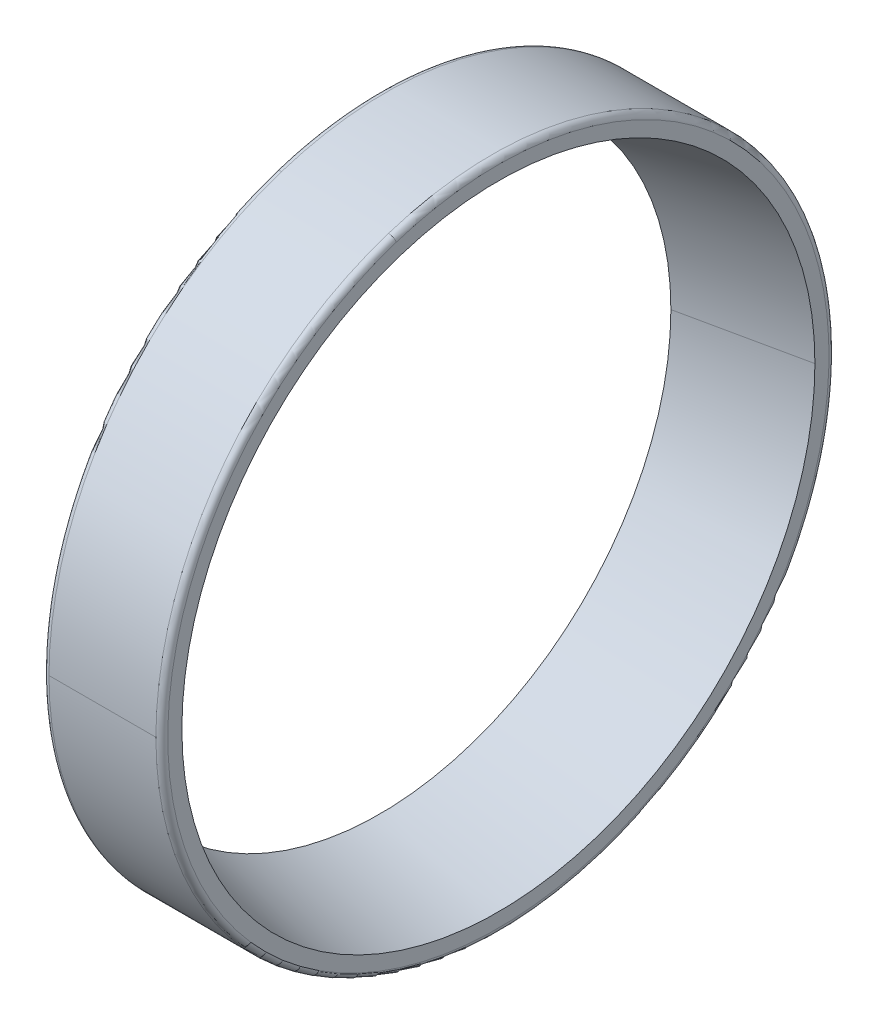
ISO-10303-21;
HEADER;
FILE_DESCRIPTION(('STEP AP214'),'2;1');
FILE_NAME('part.step','',(''),(''),'','','');
FILE_SCHEMA(('AUTOMOTIVE_DESIGN { 1 0 10303 214 1 1 1 1 }'));
ENDSEC;
DATA;
#1=APPLICATION_CONTEXT('core data for automotive mechanical design processes');
#2=APPLICATION_PROTOCOL_DEFINITION('international standard','automotive_design',2000,#1);
#3=PRODUCT_CONTEXT('',#1,'mechanical');
#4=PRODUCT('Part','Part','',(#3));
#5=PRODUCT_RELATED_PRODUCT_CATEGORY('part','',(#4));
#6=PRODUCT_DEFINITION_FORMATION('','',#4);
#7=PRODUCT_DEFINITION_CONTEXT('part definition',#1,'design');
#8=PRODUCT_DEFINITION('design','',#6,#7);
#9=PRODUCT_DEFINITION_SHAPE('','',#8);
#10=(LENGTH_UNIT() NAMED_UNIT(*) SI_UNIT(.MILLI.,.METRE.));
#11=(NAMED_UNIT(*) PLANE_ANGLE_UNIT() SI_UNIT($,.RADIAN.));
#12=(NAMED_UNIT(*) SI_UNIT($,.STERADIAN.) SOLID_ANGLE_UNIT());
#13=UNCERTAINTY_MEASURE_WITH_UNIT(LENGTH_MEASURE(1.E-05),#10,'distance_accuracy_value','');
#14=(GEOMETRIC_REPRESENTATION_CONTEXT(3) GLOBAL_UNCERTAINTY_ASSIGNED_CONTEXT((#13)) GLOBAL_UNIT_ASSIGNED_CONTEXT((#10,
#11,#12)) REPRESENTATION_CONTEXT('',''));
#15=CARTESIAN_POINT('',(0.,0.,0.));
#16=DIRECTION('',(0.,0.,1.));
#17=DIRECTION('',(1.,0.,0.));
#18=AXIS2_PLACEMENT_3D('',#15,#16,#17);
#19=CARTESIAN_POINT('',(-14.4000000000002,0.,0.));
#20=DIRECTION('',(1.,0.,0.));
#21=DIRECTION('',(0.,-0.309016994374947,0.951056516295154));
#22=AXIS2_PLACEMENT_3D('',#19,#20,#21);
#23=TOROIDAL_SURFACE('',#22,33.4,0.599999999999747);
#24=CARTESIAN_POINT('',(-14.4000000000002,-31.7652876442581,-10.3211676121232));
#25=DIRECTION('',(0.,0.309016994374946,-0.951056516295154));
#26=DIRECTION('',(3.9671969413289E-13,-0.951056516295154,-0.309016994374946));
#27=AXIS2_PLACEMENT_3D('',#24,#25,#26);
#28=CIRCLE('',#27,0.599999999999747);
#29=CARTESIAN_POINT('',(-14.4,-32.335921554035,-10.5065778087481));
#30=VERTEX_POINT('',#29);
#31=CARTESIAN_POINT('',(-15.,-31.7652876442581,-10.3211676121232));
#32=VERTEX_POINT('',#31);
#33=EDGE_CURVE('E11',#30,#32,#28,.T.);
#34=ORIENTED_EDGE('',*,*,#33,.T.);
#35=CARTESIAN_POINT('',(-15.,-31.7652876442581,-10.3211676121233));
#36=CARTESIAN_POINT('',(-15.,-31.5964187889525,-10.8409300230148));
#37=CARTESIAN_POINT('',(-15.,-31.4147717921887,-11.3565395268707));
#38=CARTESIAN_POINT('',(-15.,-31.0264067539412,-12.3782286786612));
#39=CARTESIAN_POINT('',(-15.,-30.8196887124575,-12.8843083265959));
#40=CARTESIAN_POINT('',(-15.,-30.3816668229671,-13.8857137246941));
#41=CARTESIAN_POINT('',(-15.,-30.1503629749603,-14.3810394748576));
#42=CARTESIAN_POINT('',(-15.,-29.6637301236686,-15.3597450942918));
#43=CARTESIAN_POINT('',(-15.,-29.4084011203838,-15.8431249635625));
#44=CARTESIAN_POINT('',(-15.,-28.8743321520789,-16.7967739684342));
#45=CARTESIAN_POINT('',(-15.,-28.5955921870589,-17.2670431040351));
#46=CARTESIAN_POINT('',(-15.,-28.0153730498199,-18.1933378153643));
#47=CARTESIAN_POINT('',(-15.,-27.7138938776011,-18.6493633910925));
#48=CARTESIAN_POINT('',(-15.,-27.0889225499031,-19.5460723521121));
#49=CARTESIAN_POINT('',(-15.,-26.765430394424,-19.9867557374035));
#50=CARTESIAN_POINT('',(-15.,-26.097212438772,-20.851718679376));
#51=CARTESIAN_POINT('',(-15.,-25.7524866385991,-21.2759982360572));
#52=CARTESIAN_POINT('',(-15.,-25.0426318634829,-22.1071313923992));
#53=CARTESIAN_POINT('',(-15.,-24.6775028885395,-22.5139849920601));
#54=CARTESIAN_POINT('',(-15.,-23.9277213928301,-23.3092860888849));
#55=CARTESIAN_POINT('',(-15.,-23.543068872064,-23.6977335860488));
#56=CARTESIAN_POINT('',(-15.,-22.7551669459844,-24.4552866737062));
#57=CARTESIAN_POINT('',(-15.,-22.3519175406707,-24.8243922641997));
#58=CARTESIAN_POINT('',(-15.,-21.5277933087244,-25.5423723308533));
#59=CARTESIAN_POINT('',(-15.,-21.1069184820918,-25.8912468070134));
#60=CARTESIAN_POINT('',(-15.,-20.248557331805,-26.5679241758204));
#61=CARTESIAN_POINT('',(-15.,-19.8110710081508,-26.8957270684671));
#62=CARTESIAN_POINT('',(-15.,-18.9205408067002,-27.5294715643692));
#63=CARTESIAN_POINT('',(-15.,-18.4674969289039,-27.8354131676245));
#64=CARTESIAN_POINT('',(-15.,-17.5469430415509,-28.4246980446235));
#65=CARTESIAN_POINT('',(-15.,-17.0794330319942,-28.7080413183671));
#66=CARTESIAN_POINT('',(-15.,-16.1310731536831,-29.2514469375785));
#67=CARTESIAN_POINT('',(-15.,-15.6502232849286,-29.5115092830462));
#68=CARTESIAN_POINT('',(-15.,-14.6763420976731,-30.0077265327368));
#69=CARTESIAN_POINT('',(-15.,-14.183310779172,-30.2438814369596));
#70=CARTESIAN_POINT('',(-15.,-13.186254448054,-30.6917148863113));
#71=CARTESIAN_POINT('',(-15.,-12.6822294354371,-30.9033934314402));
#72=CARTESIAN_POINT('',(-15.,-11.6643999564901,-31.3017642104479));
#73=CARTESIAN_POINT('',(-15.,-11.15059549016,-31.4884564443268));
#74=CARTESIAN_POINT('',(-15.,-10.1144449037502,-31.8364048428909));
#75=CARTESIAN_POINT('',(-15.,-9.59209878367043,-31.9976610075761));
#76=CARTESIAN_POINT('',(-15.,-8.54012326731648,-32.2943487875276));
#77=CARTESIAN_POINT('',(-15.,-8.01049387104232,-32.429780402794));
#78=CARTESIAN_POINT('',(-15.,-6.94522772590533,-32.6744928172843));
#79=CARTESIAN_POINT('',(-15.,-6.40959097704248,-32.7837736165082));
#80=CARTESIAN_POINT('',(-15.,-5.33360052257236,-32.9759211318965));
#81=CARTESIAN_POINT('',(-15.,-4.79324681696508,-33.0587878480609));
#82=CARTESIAN_POINT('',(-15.,-3.70912420841229,-33.1979075641525));
#83=CARTESIAN_POINT('',(-15.,-3.16535530546678,-33.2541605640798));
#84=CARTESIAN_POINT('',(-15.,-2.07571228915324,-33.3399173292932));
#85=CARTESIAN_POINT('',(-15.,-1.52983817578521,-33.3694210945793));
#86=CARTESIAN_POINT('',(-15.,-0.437299797178685,-33.4016083133557));
#87=CARTESIAN_POINT('',(-15.,0.109364468059809,-33.4042917668459));
#88=CARTESIAN_POINT('',(-15.,1.20216618831019,-33.382831897356));
#89=CARTESIAN_POINT('',(-15.,1.74830364332207,-33.3586885743758));
#90=CARTESIAN_POINT('',(-15.,2.8387360501541,-33.2836333153248));
#91=CARTESIAN_POINT('',(-15.,3.38303100197426,-33.232721379254));
#92=CARTESIAN_POINT('',(-15.,4.46846714820929,-33.1042515453351));
#93=CARTESIAN_POINT('',(-15.,5.00960834262417,-33.026693647487));
#94=CARTESIAN_POINT('',(-15.,6.08743331751295,-32.8451187337826));
#95=CARTESIAN_POINT('',(-15.,6.62411709798685,-32.7411017179264));
#96=CARTESIAN_POINT('',(-15.,7.69173432675854,-32.5068591543079));
#97=CARTESIAN_POINT('',(-15.,8.22266777505634,-32.3766336065456));
#98=CARTESIAN_POINT('',(-15.,9.2775052742946,-32.0902877038658));
#99=CARTESIAN_POINT('',(-15.,9.80140932523507,-31.9341673489484));
#100=CARTESIAN_POINT('',(-15.,10.8409258990114,-31.5964079395679));
#101=CARTESIAN_POINT('',(-15.,11.3565384218473,-31.4147688851049));
#102=CARTESIAN_POINT('',(-15.,12.3782297836845,-31.0264096610251));
#103=CARTESIAN_POINT('',(-15.,12.8843086226859,-30.8196894914083));
#104=CARTESIAN_POINT('',(-15.,13.8857134286039,-30.3816660440163));
#105=CARTESIAN_POINT('',(-15.,14.3810393955204,-30.1503627662411));
#106=CARTESIAN_POINT('',(-15.,15.3597451736289,-29.6637303323879));
#107=CARTESIAN_POINT('',(-15.,15.8431249848208,-29.40840117631));
#108=CARTESIAN_POINT('',(-15.,16.7967739471758,-28.8743320961528));
#109=CARTESIAN_POINT('',(-15.,17.2670430983389,-28.5955921720735));
#110=CARTESIAN_POINT('',(-15.,18.1933378210603,-28.0153730648054));
#111=CARTESIAN_POINT('',(-15.,18.6493633926187,-27.7138938816165));
#112=CARTESIAN_POINT('',(-15.,19.5460723505857,-27.0889225458879));
#113=CARTESIAN_POINT('',(-15.,19.9867557369944,-26.7654303933482));
#114=CARTESIAN_POINT('',(-15.,20.8517186797849,-26.097212439848));
#115=CARTESIAN_POINT('',(-15.,21.2759982361667,-25.7524866388875));
#116=CARTESIAN_POINT('',(-15.,22.1071313922896,-25.0426318631946));
#117=CARTESIAN_POINT('',(-15.,22.5139849920306,-24.6775028884623));
#118=CARTESIAN_POINT('',(-15.,23.3092860889142,-23.9277213929074));
#119=CARTESIAN_POINT('',(-15.,23.6977335860566,-23.5430688720848));
#120=CARTESIAN_POINT('',(-15.,24.4552866736983,-22.7551669459637));
#121=CARTESIAN_POINT('',(-15.,24.8243922641975,-22.3519175406652));
#122=CARTESIAN_POINT('',(-15.,25.5423723308553,-21.52779330873));
#123=CARTESIAN_POINT('',(-15.,25.891246807014,-21.1069184820934));
#124=CARTESIAN_POINT('',(-15.,26.5679241758198,-20.2485573318036));
#125=CARTESIAN_POINT('',(-15.,26.8957270684669,-19.8110710081505));
#126=CARTESIAN_POINT('',(-15.,27.5294715643693,-18.9205408067007));
#127=CARTESIAN_POINT('',(-15.,27.8354131676245,-18.4674969289041));
#128=CARTESIAN_POINT('',(-15.,28.4246980446234,-17.5469430415508));
#129=CARTESIAN_POINT('',(-15.,28.708041318367,-17.0794330319942));
#130=CARTESIAN_POINT('',(-15.,29.2514469375784,-16.1310731536832));
#131=CARTESIAN_POINT('',(-15.,29.5115092830462,-15.6502232849287));
#132=CARTESIAN_POINT('',(-15.,30.0077265327367,-14.6763420976731));
#133=CARTESIAN_POINT('',(-15.,30.2438814369595,-14.1833107791721));
#134=CARTESIAN_POINT('',(-15.,30.6917148863113,-13.1862544480541));
#135=CARTESIAN_POINT('',(-15.,30.9033934314402,-12.6822294354371));
#136=CARTESIAN_POINT('',(-15.,31.3017642104478,-11.6643999564902));
#137=CARTESIAN_POINT('',(-15.,31.4884564443264,-11.1505954901602));
#138=CARTESIAN_POINT('',(-15.,31.8364048428913,-10.1144449037502));
#139=CARTESIAN_POINT('',(-15.,31.9976610075776,-9.5920987836701));
#140=CARTESIAN_POINT('',(-15.,32.294348787526,-8.54012326731698));
#141=CARTESIAN_POINT('',(-15.,32.4297804027882,-8.01049387104396));
#142=CARTESIAN_POINT('',(-15.,32.67449281729,-6.94522772590386));
#143=CARTESIAN_POINT('',(-15.,32.7837736165296,-6.40959097703677));
#144=CARTESIAN_POINT('',(-15.,32.9759211318752,-5.33360052257826));
#145=CARTESIAN_POINT('',(-15.,33.0587878479811,-4.79324681698682));
#146=CARTESIAN_POINT('',(-15.,33.1979075642323,-3.70912420839073));
#147=CARTESIAN_POINT('',(-15.,33.2541605643774,-3.16535530538608));
#148=CARTESIAN_POINT('',(-15.,33.3399173289955,-2.07571228923414));
#149=CARTESIAN_POINT('',(-15.,33.3694210934685,-1.52983817608686));
#150=CARTESIAN_POINT('',(-15.,33.4016083144665,-0.437299796877262));
#151=CARTESIAN_POINT('',(-15.,33.4042917709915,0.109364469185056));
#152=CARTESIAN_POINT('',(-15.,33.3828318932104,1.20216618718472));
#153=CARTESIAN_POINT('',(-15.,33.3586885589043,1.74830363912207));
#154=CARTESIAN_POINT('',(-15.,33.2836333307964,2.83873605435391));
#155=CARTESIAN_POINT('',(-15.,33.2327214369945,3.3830310176484));
#156=CARTESIAN_POINT('',(-15.,33.1042514875946,4.46846713253499));
#157=CARTESIAN_POINT('',(-15.,33.0266934319964,5.00960828412708));
#158=CARTESIAN_POINT('',(-15.,32.8451189492732,6.08743337600989));
#159=CARTESIAN_POINT('',(-15.,32.7411025221482,6.6241173163006));
#160=CARTESIAN_POINT('',(-15.,32.5068583500861,7.69173410844461));
#161=CARTESIAN_POINT('',(-15.,32.3766306051489,8.22266696029791));
#162=CARTESIAN_POINT('',(-15.,32.0902907052625,9.27750608905285));
#163=CARTESIAN_POINT('',(-15.,31.9341785503133,9.80141236595448));
#164=CARTESIAN_POINT('',(-15.,31.7652876442582,10.3211676121231));
#165=B_SPLINE_CURVE_WITH_KNOTS('',3,(#35,#36,#37,#38,#39,#40,#41,#42,#43,#44,#45,#46,#47,#48,
#49,#50,#51,#52,#53,#54,#55,#56,#57,#58,#59,#60,#61,#62,#63,#64,#65,#66,#67,#68,#69,#70,#71,#72,
#73,#74,#75,#76,#77,#78,#79,#80,#81,#82,#83,#84,#85,#86,#87,#88,#89,#90,#91,#92,#93,#94,#95,#96,
#97,#98,#99,#100,#101,#102,#103,#104,#105,#106,#107,#108,#109,#110,#111,#112,#113,#114,#115,
#116,#117,#118,#119,#120,#121,#122,#123,#124,#125,#126,#127,#128,#129,#130,#131,#132,#133,#134,
#135,#136,#137,#138,#139,#140,#141,#142,#143,#144,#145,#146,#147,#148,#149,#150,#151,#152,#153,
#154,#155,#156,#157,#158,#159,#160,#161,#162,#163,#164),.UNSPECIFIED.,.F.,.F.,(4,2,2,2,2,2,2,2,
2,2,2,2,2,2,2,2,2,2,2,2,2,2,2,2,2,2,2,2,2,2,2,2,2,2,2,2,2,2,2,2,2,2,2,2,2,2,2,2,2,2,2,2,2,2,2,2,
2,2,2,2,2,2,2,2,4),(0.,1.63935406533053,3.27870813066108,4.91806219599161,6.55741626132216,
8.19677032665269,9.83612439198323,11.4754784573138,13.1148325226443,14.7541865879748,
16.3935406533054,18.0328947186359,19.6722487839664,21.311602849297,22.9509569146275,
24.5903109799581,26.2296650452886,27.8690191106191,29.5083731759497,31.1477272412802,
32.7870813066108,34.4264353719413,36.0657894372718,37.7051435026024,39.3444975679329,
40.9838516332635,42.623205698594,44.2625597639245,45.9019138292551,47.5412678945856,
49.1806219599161,50.8199760252467,52.4593300905772,54.0986841559077,55.7380382212383,
57.3773922865688,59.0167463518994,60.6561004172299,62.2954544825604,63.934808547891,
65.5741626132215,67.2135166785521,68.8528707438826,70.4922248092131,72.1315788745437,
73.7709329398742,75.4102870052047,77.0496410705353,78.6889951358658,80.3283492011964,
81.9677032665269,83.6070573318574,85.246411397188,86.8857654625185,88.525119527849,
90.1644735931796,91.8038276585101,93.4431817238407,95.0825357891712,96.7218898545017,
98.3612439198323,100.000597985163,101.639952050493,103.279306115824,104.918660181154),.UNSPECIFIED.);
#166=CARTESIAN_POINT('',(-15.,31.7652876442581,10.3211676121232));
#167=VERTEX_POINT('',#166);
#168=EDGE_CURVE('E26',#32,#167,#165,.T.);
#169=ORIENTED_EDGE('',*,*,#168,.T.);
#170=CARTESIAN_POINT('',(-14.4000000000002,31.7652876442581,10.3211676121232));
#171=DIRECTION('',(0.,-0.309016994374946,0.951056516295154));
#172=DIRECTION('',(3.99680288865225E-13,0.951056516295154,0.309016994374946));
#173=AXIS2_PLACEMENT_3D('',#170,#171,#172);
#174=CIRCLE('',#173,0.599999999999747);
#175=CARTESIAN_POINT('',(-14.4,32.335921554035,10.5065778087481));
#176=VERTEX_POINT('',#175);
#177=EDGE_CURVE('E221',#176,#167,#174,.T.);
#178=ORIENTED_EDGE('',*,*,#177,.F.);
#179=CARTESIAN_POINT('',(-14.4,0.,0.));
#180=DIRECTION('',(1.,0.,0.));
#181=DIRECTION('',(0.,0.,-1.));
#182=AXIS2_PLACEMENT_3D('',#179,#180,#181);
#183=CIRCLE('',#182,34.);
#184=CARTESIAN_POINT('',(-14.4,0.,-34.));
#185=VERTEX_POINT('',#184);
#186=EDGE_CURVE('E216',#185,#176,#183,.T.);
#187=ORIENTED_EDGE('',*,*,#186,.F.);
#188=CARTESIAN_POINT('',(-14.4,0.,0.));
#189=DIRECTION('',(1.,0.,0.));
#190=DIRECTION('',(0.,0.,-1.));
#191=AXIS2_PLACEMENT_3D('',#188,#189,#190);
#192=CIRCLE('',#191,34.);
#193=EDGE_CURVE('E211',#30,#185,#192,.T.);
#194=ORIENTED_EDGE('',*,*,#193,.F.);
#195=EDGE_LOOP('',(#34,#169,#178,#187,#194));
#196=FACE_BOUND('',#195,.T.);
#197=ADVANCED_FACE('F17',(#196),#23,.T.);
#198=CARTESIAN_POINT('',(-3.,0.,0.));
#199=DIRECTION('',(1.,0.,0.));
#200=DIRECTION('',(0.,1.,0.));
#201=AXIS2_PLACEMENT_3D('',#198,#199,#200);
#202=CYLINDRICAL_SURFACE('',#201,34.);
#203=DIRECTION('',(1.,0.,0.));
#204=VECTOR('',#203,1.);
#205=CARTESIAN_POINT('',(-14.4,0.,34.));
#206=LINE('',#205,#204);
#207=CARTESIAN_POINT('',(-14.4,0.,34.));
#208=VERTEX_POINT('',#207);
#209=CARTESIAN_POINT('',(-3.6,0.,34.));
#210=VERTEX_POINT('',#209);
#211=EDGE_CURVE('E206',#208,#210,#206,.T.);
#212=ORIENTED_EDGE('',*,*,#211,.F.);
#213=CARTESIAN_POINT('',(-14.4,0.,0.));
#214=DIRECTION('',(1.,0.,0.));
#215=DIRECTION('',(0.,0.,-1.));
#216=AXIS2_PLACEMENT_3D('',#213,#214,#215);
#217=CIRCLE('',#216,34.);
#218=EDGE_CURVE('E201',#208,#30,#217,.T.);
#219=ORIENTED_EDGE('',*,*,#218,.T.);
#220=ORIENTED_EDGE('',*,*,#193,.T.);
#221=DIRECTION('',(1.,0.,0.));
#222=VECTOR('',#221,1.);
#223=CARTESIAN_POINT('',(-14.4,0.,-34.));
#224=LINE('',#223,#222);
#225=CARTESIAN_POINT('',(-3.6,0.,-34.));
#226=VERTEX_POINT('',#225);
#227=EDGE_CURVE('E197',#185,#226,#224,.T.);
#228=ORIENTED_EDGE('',*,*,#227,.T.);
#229=CARTESIAN_POINT('',(-3.6,0.,0.));
#230=DIRECTION('',(1.,0.,0.));
#231=DIRECTION('',(0.,0.,-1.));
#232=AXIS2_PLACEMENT_3D('',#229,#230,#231);
#233=CIRCLE('',#232,34.);
#234=CARTESIAN_POINT('',(-3.6,-32.3359215540352,-10.5065778087482));
#235=VERTEX_POINT('',#234);
#236=EDGE_CURVE('E192',#235,#226,#233,.T.);
#237=ORIENTED_EDGE('',*,*,#236,.F.);
#238=CARTESIAN_POINT('',(-3.6,0.,0.));
#239=DIRECTION('',(1.,0.,0.));
#240=DIRECTION('',(0.,0.,-1.));
#241=AXIS2_PLACEMENT_3D('',#238,#239,#240);
#242=CIRCLE('',#241,34.);
#243=EDGE_CURVE('E187',#210,#235,#242,.T.);
#244=ORIENTED_EDGE('',*,*,#243,.F.);
#245=EDGE_LOOP('',(#212,#219,#220,#228,#237,#244));
#246=FACE_BOUND('',#245,.T.);
#247=ADVANCED_FACE('F242',(#246),#202,.T.);
#248=CARTESIAN_POINT('',(-3.59999999999993,0.,0.));
#249=DIRECTION('',(1.,0.,0.));
#250=DIRECTION('',(0.,0.309016994374947,-0.951056516295154));
#251=AXIS2_PLACEMENT_3D('',#248,#249,#250);
#252=TOROIDAL_SURFACE('',#251,33.4,0.59999999999993);
#253=CARTESIAN_POINT('',(-3.59999999999993,-31.7652876442581,-10.3211676121232));
#254=DIRECTION('',(0.,0.309016994374947,-0.951056516295154));
#255=DIRECTION('',(1.,0.,0.));
#256=AXIS2_PLACEMENT_3D('',#253,#254,#255);
#257=CIRCLE('',#256,0.59999999999993);
#258=CARTESIAN_POINT('',(-3.,-31.7652876442581,-10.3211676121232));
#259=VERTEX_POINT('',#258);
#260=EDGE_CURVE('E182',#259,#235,#257,.T.);
#261=ORIENTED_EDGE('',*,*,#260,.F.);
#262=CARTESIAN_POINT('',(-3.,0.,0.));
#263=DIRECTION('',(1.,0.,0.));
#264=DIRECTION('',(0.,0.,-1.));
#265=AXIS2_PLACEMENT_3D('',#262,#263,#264);
#266=CIRCLE('',#265,33.4);
#267=CARTESIAN_POINT('',(-3.,31.7652876442581,10.3211676121232));
#268=VERTEX_POINT('',#267);
#269=EDGE_CURVE('E177',#268,#259,#266,.T.);
#270=ORIENTED_EDGE('',*,*,#269,.F.);
#271=CARTESIAN_POINT('',(-3.59999999999993,31.7652876442581,10.3211676121232));
#272=DIRECTION('',(0.,-0.309016994374947,0.951056516295154));
#273=DIRECTION('',(1.,0.,0.));
#274=AXIS2_PLACEMENT_3D('',#271,#272,#273);
#275=CIRCLE('',#274,0.59999999999993);
#276=CARTESIAN_POINT('',(-3.6,32.3359215540352,10.5065778087482));
#277=VERTEX_POINT('',#276);
#278=EDGE_CURVE('E173',#268,#277,#275,.T.);
#279=ORIENTED_EDGE('',*,*,#278,.T.);
#280=CARTESIAN_POINT('',(-3.6,0.,0.));
#281=DIRECTION('',(1.,0.,0.));
#282=DIRECTION('',(0.,0.,-1.));
#283=AXIS2_PLACEMENT_3D('',#280,#281,#282);
#284=CIRCLE('',#283,34.);
#285=EDGE_CURVE('E168',#277,#210,#284,.T.);
#286=ORIENTED_EDGE('',*,*,#285,.T.);
#287=ORIENTED_EDGE('',*,*,#243,.T.);
#288=EDGE_LOOP('',(#261,#270,#279,#286,#287));
#289=FACE_BOUND('',#288,.T.);
#290=ADVANCED_FACE('F244',(#289),#252,.T.);
#291=CARTESIAN_POINT('',(-3.,0.,0.));
#292=DIRECTION('',(1.,0.,0.));
#293=DIRECTION('',(0.,-1.,0.));
#294=AXIS2_PLACEMENT_3D('',#291,#292,#293);
#295=CYLINDRICAL_SURFACE('',#294,34.);
#296=ORIENTED_EDGE('',*,*,#211,.T.);
#297=ORIENTED_EDGE('',*,*,#285,.F.);
#298=CARTESIAN_POINT('',(-3.6,0.,0.));
#299=DIRECTION('',(1.,0.,0.));
#300=DIRECTION('',(0.,0.,-1.));
#301=AXIS2_PLACEMENT_3D('',#298,#299,#300);
#302=CIRCLE('',#301,34.);
#303=EDGE_CURVE('E163',#226,#277,#302,.T.);
#304=ORIENTED_EDGE('',*,*,#303,.F.);
#305=ORIENTED_EDGE('',*,*,#227,.F.);
#306=ORIENTED_EDGE('',*,*,#186,.T.);
#307=CARTESIAN_POINT('',(-14.4,0.,0.));
#308=DIRECTION('',(1.,0.,0.));
#309=DIRECTION('',(0.,0.,-1.));
#310=AXIS2_PLACEMENT_3D('',#307,#308,#309);
#311=CIRCLE('',#310,34.);
#312=EDGE_CURVE('E160',#176,#208,#311,.T.);
#313=ORIENTED_EDGE('',*,*,#312,.T.);
#314=EDGE_LOOP('',(#296,#297,#304,#305,#306,#313));
#315=FACE_BOUND('',#314,.T.);
#316=ADVANCED_FACE('F238',(#315),#295,.T.);
#317=CARTESIAN_POINT('',(-14.4000000000002,0.,0.));
#318=DIRECTION('',(1.,0.,0.));
#319=DIRECTION('',(0.,0.309016994374947,-0.951056516295154));
#320=AXIS2_PLACEMENT_3D('',#317,#318,#319);
#321=TOROIDAL_SURFACE('',#320,33.4,0.599999999999747);
#322=ORIENTED_EDGE('',*,*,#33,.F.);
#323=ORIENTED_EDGE('',*,*,#218,.F.);
#324=ORIENTED_EDGE('',*,*,#312,.F.);
#325=ORIENTED_EDGE('',*,*,#177,.T.);
#326=CARTESIAN_POINT('',(-15.,31.7652876442581,10.3211676121233));
#327=CARTESIAN_POINT('',(-15.,31.5964187889525,10.8409300230148));
#328=CARTESIAN_POINT('',(-15.,31.4147717921887,11.3565395268707));
#329=CARTESIAN_POINT('',(-15.,31.0264067539412,12.3782286786612));
#330=CARTESIAN_POINT('',(-15.,30.8196887124575,12.8843083265959));
#331=CARTESIAN_POINT('',(-15.,30.3816668229671,13.8857137246941));
#332=CARTESIAN_POINT('',(-15.,30.1503629749603,14.3810394748576));
#333=CARTESIAN_POINT('',(-15.,29.6637301236686,15.3597450942918));
#334=CARTESIAN_POINT('',(-15.,29.4084011203838,15.8431249635626));
#335=CARTESIAN_POINT('',(-15.,28.8743321520789,16.7967739684342));
#336=CARTESIAN_POINT('',(-15.,28.5955921870589,17.2670431040351));
#337=CARTESIAN_POINT('',(-15.,28.0153730498199,18.1933378153643));
#338=CARTESIAN_POINT('',(-15.,27.7138938776011,18.6493633910925));
#339=CARTESIAN_POINT('',(-15.,27.0889225499031,19.5460723521121));
#340=CARTESIAN_POINT('',(-15.,26.765430394424,19.9867557374035));
#341=CARTESIAN_POINT('',(-15.,26.097212438772,20.851718679376));
#342=CARTESIAN_POINT('',(-15.,25.7524866385991,21.2759982360572));
#343=CARTESIAN_POINT('',(-15.,25.0426318634828,22.1071313923992));
#344=CARTESIAN_POINT('',(-15.,24.6775028885395,22.5139849920601));
#345=CARTESIAN_POINT('',(-15.,23.92772139283,23.3092860888849));
#346=CARTESIAN_POINT('',(-15.,23.543068872064,23.6977335860488));
#347=CARTESIAN_POINT('',(-15.,22.7551669459843,24.4552866737062));
#348=CARTESIAN_POINT('',(-15.,22.3519175406707,24.8243922641997));
#349=CARTESIAN_POINT('',(-15.,21.5277933087244,25.5423723308533));
#350=CARTESIAN_POINT('',(-15.,21.1069184820918,25.8912468070135));
#351=CARTESIAN_POINT('',(-15.,20.248557331805,26.5679241758204));
#352=CARTESIAN_POINT('',(-15.,19.8110710081508,26.8957270684671));
#353=CARTESIAN_POINT('',(-15.,18.9205408067002,27.5294715643692));
#354=CARTESIAN_POINT('',(-15.,18.4674969289039,27.8354131676245));
#355=CARTESIAN_POINT('',(-15.,17.5469430415508,28.4246980446235));
#356=CARTESIAN_POINT('',(-15.,17.0794330319942,28.7080413183671));
#357=CARTESIAN_POINT('',(-15.,16.131073153683,29.2514469375785));
#358=CARTESIAN_POINT('',(-15.,15.6502232849286,29.5115092830462));
#359=CARTESIAN_POINT('',(-15.,14.676342097673,30.0077265327368));
#360=CARTESIAN_POINT('',(-15.,14.183310779172,30.2438814369596));
#361=CARTESIAN_POINT('',(-15.,13.186254448054,30.6917148863113));
#362=CARTESIAN_POINT('',(-15.,12.682229435437,30.9033934314402));
#363=CARTESIAN_POINT('',(-15.,11.66439995649,31.3017642104479));
#364=CARTESIAN_POINT('',(-15.,11.15059549016,31.4884564443268));
#365=CARTESIAN_POINT('',(-15.,10.1144449037502,31.8364048428909));
#366=CARTESIAN_POINT('',(-15.,9.59209878367039,31.9976610075761));
#367=CARTESIAN_POINT('',(-15.,8.54012326731645,32.2943487875276));
#368=CARTESIAN_POINT('',(-15.,8.01049387104229,32.429780402794));
#369=CARTESIAN_POINT('',(-15.,6.94522772590529,32.6744928172843));
#370=CARTESIAN_POINT('',(-15.,6.40959097704244,32.7837736165082));
#371=CARTESIAN_POINT('',(-15.,5.33360052257231,32.9759211318966));
#372=CARTESIAN_POINT('',(-15.,4.79324681696504,33.0587878480609));
#373=CARTESIAN_POINT('',(-15.,3.70912420841225,33.1979075641525));
#374=CARTESIAN_POINT('',(-15.,3.16535530546673,33.2541605640798));
#375=CARTESIAN_POINT('',(-15.,2.0757122891532,33.3399173292932));
#376=CARTESIAN_POINT('',(-15.,1.52983817578517,33.3694210945793));
#377=CARTESIAN_POINT('',(-15.,0.437299797178647,33.4016083133557));
#378=CARTESIAN_POINT('',(-15.,-0.109364468059853,33.4042917668459));
#379=CARTESIAN_POINT('',(-15.,-1.20216618831024,33.382831897356));
#380=CARTESIAN_POINT('',(-15.,-1.74830364332212,33.3586885743758));
#381=CARTESIAN_POINT('',(-15.,-2.83873605015416,33.2836333153248));
#382=CARTESIAN_POINT('',(-15.,-3.38303100197432,33.232721379254));
#383=CARTESIAN_POINT('',(-15.,-4.46846714820935,33.1042515453351));
#384=CARTESIAN_POINT('',(-15.,-5.00960834262423,33.026693647487));
#385=CARTESIAN_POINT('',(-15.,-6.08743331751301,32.8451187337826));
#386=CARTESIAN_POINT('',(-15.,-6.62411709798691,32.7411017179264));
#387=CARTESIAN_POINT('',(-15.,-7.6917343267586,32.5068591543079));
#388=CARTESIAN_POINT('',(-15.,-8.2226677750564,32.3766336065456));
#389=CARTESIAN_POINT('',(-15.,-9.27750527429466,32.0902877038658));
#390=CARTESIAN_POINT('',(-15.,-9.80140932523513,31.9341673489484));
#391=CARTESIAN_POINT('',(-15.,-10.8409258990115,31.5964079395679));
#392=CARTESIAN_POINT('',(-15.,-11.3565384218473,31.4147688851048));
#393=CARTESIAN_POINT('',(-15.,-12.3782297836846,31.0264096610251));
#394=CARTESIAN_POINT('',(-15.,-12.884308622686,30.8196894914083));
#395=CARTESIAN_POINT('',(-15.,-13.8857134286039,30.3816660440163));
#396=CARTESIAN_POINT('',(-15.,-14.3810393955205,30.150362766241));
#397=CARTESIAN_POINT('',(-15.,-15.3597451736289,29.6637303323879));
#398=CARTESIAN_POINT('',(-15.,-15.8431249848208,29.40840117631));
#399=CARTESIAN_POINT('',(-15.,-16.7967739471758,28.8743320961528));
#400=CARTESIAN_POINT('',(-15.,-17.2670430983389,28.5955921720735));
#401=CARTESIAN_POINT('',(-15.,-18.1933378210604,28.0153730648053));
#402=CARTESIAN_POINT('',(-15.,-18.6493633926188,27.7138938816164));
#403=CARTESIAN_POINT('',(-15.,-19.5460723505858,27.0889225458878));
#404=CARTESIAN_POINT('',(-15.,-19.9867557369945,26.7654303933481));
#405=CARTESIAN_POINT('',(-15.,-20.8517186797849,26.0972124398479));
#406=CARTESIAN_POINT('',(-15.,-21.2759982361667,25.7524866388874));
#407=CARTESIAN_POINT('',(-15.,-22.1071313922896,25.0426318631946));
#408=CARTESIAN_POINT('',(-15.,-22.5139849920307,24.6775028884622));
#409=CARTESIAN_POINT('',(-15.,-23.3092860889142,23.9277213929073));
#410=CARTESIAN_POINT('',(-15.,-23.6977335860567,23.5430688720848));
#411=CARTESIAN_POINT('',(-15.,-24.4552866736983,22.7551669459637));
#412=CARTESIAN_POINT('',(-15.,-24.8243922641976,22.3519175406651));
#413=CARTESIAN_POINT('',(-15.,-25.5423723308554,21.52779330873));
#414=CARTESIAN_POINT('',(-15.,-25.891246807014,21.1069184820933));
#415=CARTESIAN_POINT('',(-15.,-26.5679241758198,20.2485573318035));
#416=CARTESIAN_POINT('',(-15.,-26.895727068467,19.8110710081504));
#417=CARTESIAN_POINT('',(-15.,-27.5294715643694,18.9205408067006));
#418=CARTESIAN_POINT('',(-15.,-27.8354131676246,18.467496928904));
#419=CARTESIAN_POINT('',(-15.,-28.4246980446234,17.5469430415508));
#420=CARTESIAN_POINT('',(-15.,-28.7080413183671,17.0794330319942));
#421=CARTESIAN_POINT('',(-15.,-29.2514469375785,16.1310731536831));
#422=CARTESIAN_POINT('',(-15.,-29.5115092830462,15.6502232849286));
#423=CARTESIAN_POINT('',(-15.,-30.0077265327368,14.6763420976731));
#424=CARTESIAN_POINT('',(-15.,-30.2438814369596,14.183310779172));
#425=CARTESIAN_POINT('',(-15.,-30.6917148863113,13.186254448054));
#426=CARTESIAN_POINT('',(-15.,-30.9033934314403,12.682229435437));
#427=CARTESIAN_POINT('',(-15.,-31.3017642104478,11.6643999564901));
#428=CARTESIAN_POINT('',(-15.,-31.4884564443264,11.1505954901602));
#429=CARTESIAN_POINT('',(-15.,-31.8364048428913,10.1144449037501));
#430=CARTESIAN_POINT('',(-15.,-31.9976610075776,9.59209878367001));
#431=CARTESIAN_POINT('',(-15.,-32.2943487875261,8.5401232673169));
#432=CARTESIAN_POINT('',(-15.,-32.4297804027882,8.01049387104388));
#433=CARTESIAN_POINT('',(-15.,-32.67449281729,6.94522772590377));
#434=CARTESIAN_POINT('',(-15.,-32.7837736165296,6.40959097703668));
#435=CARTESIAN_POINT('',(-15.,-32.9759211318752,5.33360052257815));
#436=CARTESIAN_POINT('',(-15.,-33.0587878479812,4.79324681698671));
#437=CARTESIAN_POINT('',(-15.,-33.1979075642323,3.70912420839061));
#438=CARTESIAN_POINT('',(-15.,-33.2541605643774,3.16535530538595));
#439=CARTESIAN_POINT('',(-15.,-33.3399173289955,2.07571228923401));
#440=CARTESIAN_POINT('',(-15.,-33.3694210934685,1.52983817608674));
#441=CARTESIAN_POINT('',(-15.,-33.4016083144665,0.43729979687714));
#442=CARTESIAN_POINT('',(-15.,-33.4042917709915,-0.109364469185179));
#443=CARTESIAN_POINT('',(-15.,-33.3828318932104,-1.20216618718484));
#444=CARTESIAN_POINT('',(-15.,-33.3586885589043,-1.74830363912219));
#445=CARTESIAN_POINT('',(-15.,-33.2836333307964,-2.83873605435403));
#446=CARTESIAN_POINT('',(-15.,-33.2327214369945,-3.38303101764852));
#447=CARTESIAN_POINT('',(-15.,-33.1042514875945,-4.46846713253511));
#448=CARTESIAN_POINT('',(-15.,-33.0266934319964,-5.0096082841272));
#449=CARTESIAN_POINT('',(-15.,-32.8451189492732,-6.08743337601001));
#450=CARTESIAN_POINT('',(-15.,-32.7411025221482,-6.62411731630072));
#451=CARTESIAN_POINT('',(-15.,-32.506858350086,-7.69173410844473));
#452=CARTESIAN_POINT('',(-15.,-32.3766306051489,-8.22266696029803));
#453=CARTESIAN_POINT('',(-15.,-32.0902907052625,-9.27750608905296));
#454=CARTESIAN_POINT('',(-15.,-31.9341785503133,-9.8014123659546));
#455=CARTESIAN_POINT('',(-15.,-31.7652876442581,-10.3211676121233));
#456=B_SPLINE_CURVE_WITH_KNOTS('',3,(#326,#327,#328,#329,#330,#331,#332,#333,#334,#335,#336,
#337,#338,#339,#340,#341,#342,#343,#344,#345,#346,#347,#348,#349,#350,#351,#352,#353,#354,#355,
#356,#357,#358,#359,#360,#361,#362,#363,#364,#365,#366,#367,#368,#369,#370,#371,#372,#373,#374,
#375,#376,#377,#378,#379,#380,#381,#382,#383,#384,#385,#386,#387,#388,#389,#390,#391,#392,#393,
#394,#395,#396,#397,#398,#399,#400,#401,#402,#403,#404,#405,#406,#407,#408,#409,#410,#411,#412,
#413,#414,#415,#416,#417,#418,#419,#420,#421,#422,#423,#424,#425,#426,#427,#428,#429,#430,#431,
#432,#433,#434,#435,#436,#437,#438,#439,#440,#441,#442,#443,#444,#445,#446,#447,#448,#449,#450,
#451,#452,#453,#454,#455),.UNSPECIFIED.,.F.,.F.,(4,2,2,2,2,2,2,2,2,2,2,2,2,2,2,2,2,2,2,2,2,2,2,
2,2,2,2,2,2,2,2,2,2,2,2,2,2,2,2,2,2,2,2,2,2,2,2,2,2,2,2,2,2,2,2,2,2,2,2,2,2,2,2,2,4),(0.,
1.63935406533053,3.27870813066108,4.91806219599162,6.55741626132216,8.1967703266527,
9.83612439198324,11.4754784573138,13.1148325226443,14.7541865879749,16.3935406533054,
18.0328947186359,19.6722487839665,21.311602849297,22.9509569146276,24.5903109799581,
26.2296650452886,27.8690191106192,29.5083731759497,31.1477272412803,32.7870813066108,
34.4264353719413,36.0657894372719,37.7051435026024,39.3444975679329,40.9838516332635,
42.623205698594,44.2625597639246,45.9019138292551,47.5412678945857,49.1806219599162,
50.8199760252467,52.4593300905773,54.0986841559078,55.7380382212383,57.3773922865689,
59.0167463518994,60.65610041723,62.2954544825605,63.934808547891,65.5741626132216,
67.2135166785521,68.8528707438827,70.4922248092132,72.1315788745438,73.7709329398743,
75.4102870052048,77.0496410705354,78.6889951358659,80.3283492011965,81.967703266527,
83.6070573318576,85.2464113971881,86.8857654625186,88.5251195278492,90.1644735931797,
91.8038276585103,93.4431817238408,95.0825357891713,96.7218898545019,98.3612439198324,
100.000597985163,101.639952050494,103.279306115824,104.918660181155),.UNSPECIFIED.);
#457=EDGE_CURVE('E146',#167,#32,#456,.T.);
#458=ORIENTED_EDGE('',*,*,#457,.T.);
#459=EDGE_LOOP('',(#322,#323,#324,#325,#458));
#460=FACE_BOUND('',#459,.T.);
#461=ADVANCED_FACE('F126',(#460),#321,.T.);
#462=CARTESIAN_POINT('',(-15.,33.4,0.));
#463=DIRECTION('',(-1.,0.,0.));
#464=DIRECTION('',(0.,0.,1.));
#465=AXIS2_PLACEMENT_3D('',#462,#463,#464);
#466=PLANE('',#465);
#467=CARTESIAN_POINT('',(-15.,0.,0.));
#468=DIRECTION('',(1.,0.,0.));
#469=DIRECTION('',(0.,0.,-1.));
#470=AXIS2_PLACEMENT_3D('',#467,#468,#469);
#471=CIRCLE('',#470,29.426);
#472=CARTESIAN_POINT('',(-15.,0.,-29.426));
#473=VERTEX_POINT('',#472);
#474=CARTESIAN_POINT('',(-15.,0.,29.426));
#475=VERTEX_POINT('',#474);
#476=EDGE_CURVE('E98',#473,#475,#471,.T.);
#477=ORIENTED_EDGE('',*,*,#476,.T.);
#478=CARTESIAN_POINT('',(-15.,0.,0.));
#479=DIRECTION('',(1.,0.,0.));
#480=DIRECTION('',(0.,0.,-1.));
#481=AXIS2_PLACEMENT_3D('',#478,#479,#480);
#482=CIRCLE('',#481,29.426);
#483=EDGE_CURVE('E108',#475,#473,#482,.T.);
#484=ORIENTED_EDGE('',*,*,#483,.T.);
#485=EDGE_LOOP('',(#477,#484));
#486=FACE_BOUND('',#485,.T.);
#487=ORIENTED_EDGE('',*,*,#168,.F.);
#488=ORIENTED_EDGE('',*,*,#457,.F.);
#489=EDGE_LOOP('',(#487,#488));
#490=FACE_BOUND('',#489,.T.);
#491=ADVANCED_FACE('F116',(#486,#490),#466,.T.);
#492=CARTESIAN_POINT('',(-15.,0.,0.));
#493=DIRECTION('',(1.,0.,0.));
#494=DIRECTION('',(0.,1.,0.));
#495=AXIS2_PLACEMENT_3D('',#492,#493,#494);
#496=CONICAL_SURFACE('',#495,29.426,0.209425259063146);
#497=DIRECTION('',(0.978150563620611,0.,0.207897751042865));
#498=VECTOR('',#497,1.);
#499=CARTESIAN_POINT('',(-15.,0.,29.426));
#500=LINE('',#499,#498);
#501=CARTESIAN_POINT('',(-2.99999999999997,0.,31.9765));
#502=VERTEX_POINT('',#501);
#503=EDGE_CURVE('E88',#475,#502,#500,.T.);
#504=ORIENTED_EDGE('',*,*,#503,.T.);
#505=CARTESIAN_POINT('',(-3.,0.,0.));
#506=DIRECTION('',(1.,0.,0.));
#507=DIRECTION('',(0.,0.,-1.));
#508=AXIS2_PLACEMENT_3D('',#505,#506,#507);
#509=CIRCLE('',#508,31.9765);
#510=CARTESIAN_POINT('',(-3.,0.,-31.9765));
#511=VERTEX_POINT('',#510);
#512=EDGE_CURVE('E80',#502,#511,#509,.T.);
#513=ORIENTED_EDGE('',*,*,#512,.T.);
#514=DIRECTION('',(0.978150563620611,0.,-0.207897751042865));
#515=VECTOR('',#514,1.);
#516=CARTESIAN_POINT('',(-15.,0.,-29.426));
#517=LINE('',#516,#515);
#518=EDGE_CURVE('E85',#473,#511,#517,.T.);
#519=ORIENTED_EDGE('',*,*,#518,.F.);
#520=ORIENTED_EDGE('',*,*,#483,.F.);
#521=EDGE_LOOP('',(#504,#513,#519,#520));
#522=FACE_BOUND('',#521,.T.);
#523=ADVANCED_FACE('F82',(#522),#496,.F.);
#524=CARTESIAN_POINT('',(-15.,0.,0.));
#525=DIRECTION('',(1.,0.,0.));
#526=DIRECTION('',(0.,-1.,0.));
#527=AXIS2_PLACEMENT_3D('',#524,#525,#526);
#528=CONICAL_SURFACE('',#527,29.426,0.209425259063146);
#529=ORIENTED_EDGE('',*,*,#503,.F.);
#530=ORIENTED_EDGE('',*,*,#476,.F.);
#531=ORIENTED_EDGE('',*,*,#518,.T.);
#532=CARTESIAN_POINT('',(-3.,0.,0.));
#533=DIRECTION('',(1.,0.,0.));
#534=DIRECTION('',(0.,0.,-1.));
#535=AXIS2_PLACEMENT_3D('',#532,#533,#534);
#536=CIRCLE('',#535,31.9765);
#537=EDGE_CURVE('E92',#511,#502,#536,.T.);
#538=ORIENTED_EDGE('',*,*,#537,.T.);
#539=EDGE_LOOP('',(#529,#530,#531,#538));
#540=FACE_BOUND('',#539,.T.);
#541=ADVANCED_FACE('F97',(#540),#528,.F.);
#542=CARTESIAN_POINT('',(-3.,31.9765,0.));
#543=DIRECTION('',(1.,0.,0.));
#544=DIRECTION('',(0.,0.,-1.));
#545=AXIS2_PLACEMENT_3D('',#542,#543,#544);
#546=PLANE('',#545);
#547=ORIENTED_EDGE('',*,*,#269,.T.);
#548=CARTESIAN_POINT('',(-3.,-31.7652876442581,-10.3211676121232));
#549=CARTESIAN_POINT('',(-3.,-30.1439765781931,-15.3108006402252));
#550=CARTESIAN_POINT('',(-3.,-27.5433568769419,-19.9823925817123));
#551=CARTESIAN_POINT('',(-3.,-24.0449906084082,-24.0782324654198));
#552=CARTESIAN_POINT('',(-3.,-15.6308644923823,-30.6772871588463));
#553=CARTESIAN_POINT('',(-3.,-5.34641117203071,-33.6056648484535));
#554=CARTESIAN_POINT('',(-3.,0.0235068262558549,-34.0282957175374));
#555=CARTESIAN_POINT('',(-3.,10.6394253303731,-32.7447841842949));
#556=CARTESIAN_POINT('',(-3.,19.9823129614908,-27.5432864909054));
#557=CARTESIAN_POINT('',(-3.,24.0782516884934,-24.0450123300563));
#558=CARTESIAN_POINT('',(-3.,30.6772919834204,-15.6308550236226));
#559=CARTESIAN_POINT('',(-3.,33.6056359762318,-5.34640838790193));
#560=CARTESIAN_POINT('',(-3.,34.0283994606293,0.0234837840178788));
#561=CARTESIAN_POINT('',(-3.,33.3864521469131,5.33148696268258));
#562=CARTESIAN_POINT('',(-3.,31.7652876442581,10.3211676121232));
#563=B_SPLINE_CURVE_WITH_KNOTS('',5,(#548,#549,#550,#551,#552,#553,#554,#555,#556,#557,#558,
#559,#560,#561,#562),.UNSPECIFIED.,.F.,.F.,(6,3,3,3,6),(0.,0.785398163397448,1.5707963267949,
2.35619449019234,3.14159265358979),.UNSPECIFIED.);
#564=EDGE_CURVE('E95',#259,#268,#563,.T.);
#565=ORIENTED_EDGE('',*,*,#564,.T.);
#566=EDGE_LOOP('',(#547,#565));
#567=FACE_BOUND('',#566,.T.);
#568=ORIENTED_EDGE('',*,*,#512,.F.);
#569=ORIENTED_EDGE('',*,*,#537,.F.);
#570=EDGE_LOOP('',(#568,#569));
#571=FACE_BOUND('',#570,.T.);
#572=ADVANCED_FACE('F93',(#567,#571),#546,.T.);
#573=CARTESIAN_POINT('',(-3.59999999999993,0.,0.));
#574=DIRECTION('',(1.,0.,0.));
#575=DIRECTION('',(0.,-0.309016994374947,0.951056516295154));
#576=AXIS2_PLACEMENT_3D('',#573,#574,#575);
#577=TOROIDAL_SURFACE('',#576,33.4,0.59999999999993);
#578=ORIENTED_EDGE('',*,*,#260,.T.);
#579=ORIENTED_EDGE('',*,*,#236,.T.);
#580=ORIENTED_EDGE('',*,*,#303,.T.);
#581=ORIENTED_EDGE('',*,*,#278,.F.);
#582=ORIENTED_EDGE('',*,*,#564,.F.);
#583=EDGE_LOOP('',(#578,#579,#580,#581,#582));
#584=FACE_BOUND('',#583,.T.);
#585=ADVANCED_FACE('F249',(#584),#577,.T.);
#586=CLOSED_SHELL('',(#197,#247,#290,#316,#461,#491,#523,#541,#572,#585));
#587=MANIFOLD_SOLID_BREP('B1',#586);
#588=ADVANCED_BREP_SHAPE_REPRESENTATION('',(#18,#587),#14);
#589=SHAPE_DEFINITION_REPRESENTATION(#9,#588);
ENDSEC;
END-ISO-10303-21;
